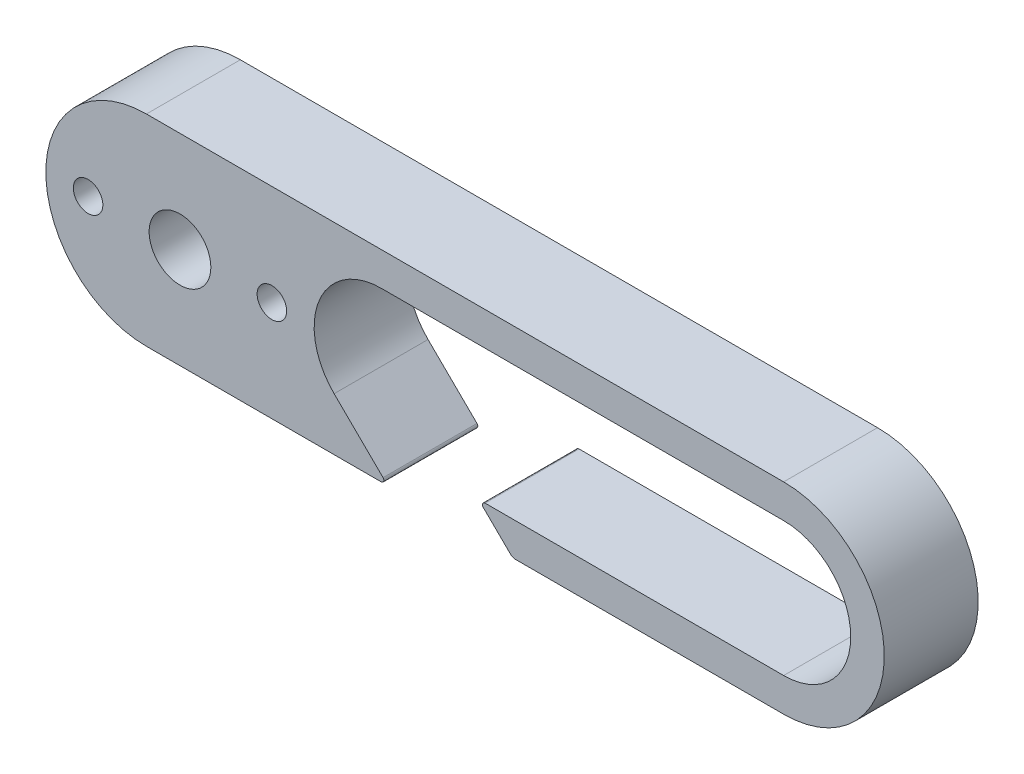
ISO-10303-21;
HEADER;
FILE_DESCRIPTION(('STEP AP214'),'2;1');
FILE_NAME('part.step','',(''),(''),'','','');
FILE_SCHEMA(('AUTOMOTIVE_DESIGN { 1 0 10303 214 1 1 1 1 }'));
ENDSEC;
DATA;
#1=APPLICATION_CONTEXT('core data for automotive mechanical design processes');
#2=APPLICATION_PROTOCOL_DEFINITION('international standard','automotive_design',2000,#1);
#3=PRODUCT_CONTEXT('',#1,'mechanical');
#4=PRODUCT('Part','Part','',(#3));
#5=PRODUCT_RELATED_PRODUCT_CATEGORY('part','',(#4));
#6=PRODUCT_DEFINITION_FORMATION('','',#4);
#7=PRODUCT_DEFINITION_CONTEXT('part definition',#1,'design');
#8=PRODUCT_DEFINITION('design','',#6,#7);
#9=PRODUCT_DEFINITION_SHAPE('','',#8);
#10=(LENGTH_UNIT() NAMED_UNIT(*) SI_UNIT(.MILLI.,.METRE.));
#11=(NAMED_UNIT(*) PLANE_ANGLE_UNIT() SI_UNIT($,.RADIAN.));
#12=(NAMED_UNIT(*) SI_UNIT($,.STERADIAN.) SOLID_ANGLE_UNIT());
#13=UNCERTAINTY_MEASURE_WITH_UNIT(LENGTH_MEASURE(1.E-05),#10,'distance_accuracy_value','');
#14=(GEOMETRIC_REPRESENTATION_CONTEXT(3) GLOBAL_UNCERTAINTY_ASSIGNED_CONTEXT((#13)) GLOBAL_UNIT_ASSIGNED_CONTEXT((#10,
#11,#12)) REPRESENTATION_CONTEXT('',''));
#15=CARTESIAN_POINT('',(0.,0.,0.));
#16=DIRECTION('',(0.,0.,1.));
#17=DIRECTION('',(1.,0.,0.));
#18=AXIS2_PLACEMENT_3D('',#15,#16,#17);
#19=CARTESIAN_POINT('',(0.,-7.5,7.));
#20=DIRECTION('',(0.,1.,0.));
#21=DIRECTION('',(0.,0.,1.));
#22=AXIS2_PLACEMENT_3D('',#19,#20,#21);
#23=PLANE('',#22);
#24=DIRECTION('',(1.,0.,0.));
#25=VECTOR('',#24,1.);
#26=CARTESIAN_POINT('',(0.,-7.5,0.));
#27=LINE('',#26,#25);
#28=CARTESIAN_POINT('',(-0.729629901181416,-7.5,0.));
#29=VERTEX_POINT('',#28);
#30=CARTESIAN_POINT('',(16.7703700988186,-7.5,0.));
#31=VERTEX_POINT('',#30);
#32=EDGE_CURVE('E177',#29,#31,#27,.T.);
#33=ORIENTED_EDGE('',*,*,#32,.T.);
#34=DIRECTION('',(0.,0.,-1.));
#35=VECTOR('',#34,1.);
#36=CARTESIAN_POINT('',(16.7703700988186,-7.5,7.));
#37=LINE('',#36,#35);
#38=CARTESIAN_POINT('',(16.7703700988186,-7.5,7.));
#39=VERTEX_POINT('',#38);
#40=EDGE_CURVE('E11',#39,#31,#37,.T.);
#41=ORIENTED_EDGE('',*,*,#40,.F.);
#42=DIRECTION('',(1.,0.,0.));
#43=VECTOR('',#42,1.);
#44=CARTESIAN_POINT('',(0.,-7.5,7.));
#45=LINE('',#44,#43);
#46=CARTESIAN_POINT('',(-0.729629901181416,-7.5,7.));
#47=VERTEX_POINT('',#46);
#48=EDGE_CURVE('E254',#47,#39,#45,.T.);
#49=ORIENTED_EDGE('',*,*,#48,.F.);
#50=DIRECTION('',(0.,0.,-1.));
#51=VECTOR('',#50,1.);
#52=CARTESIAN_POINT('',(-0.729629901181416,-7.5,7.));
#53=LINE('',#52,#51);
#54=EDGE_CURVE('E164',#47,#29,#53,.T.);
#55=ORIENTED_EDGE('',*,*,#54,.T.);
#56=EDGE_LOOP('',(#33,#41,#49,#55));
#57=FACE_BOUND('',#56,.T.);
#58=ADVANCED_FACE('F35',(#57),#23,.F.);
#59=CARTESIAN_POINT('',(16.7703700988186,-7.3,7.));
#60=DIRECTION('',(0.,0.,-1.));
#61=DIRECTION('',(-1.,0.,0.));
#62=AXIS2_PLACEMENT_3D('',#59,#60,#61);
#63=CYLINDRICAL_SURFACE('',#62,0.2);
#64=CARTESIAN_POINT('',(16.7703700988186,-7.3,0.));
#65=DIRECTION('',(0.,0.,1.));
#66=DIRECTION('',(1.,0.,0.));
#67=AXIS2_PLACEMENT_3D('',#64,#65,#66);
#68=CIRCLE('',#67,0.2);
#69=CARTESIAN_POINT('',(16.9094151219063,-7.15624158614354,0.));
#70=VERTEX_POINT('',#69);
#71=EDGE_CURVE('E180',#31,#70,#68,.T.);
#72=ORIENTED_EDGE('',*,*,#71,.T.);
#73=DIRECTION('',(0.,0.,-1.));
#74=VECTOR('',#73,1.);
#75=CARTESIAN_POINT('',(16.9094151219063,-7.15624158614354,7.));
#76=LINE('',#75,#74);
#77=CARTESIAN_POINT('',(16.9094151219063,-7.15624158614354,7.));
#78=VERTEX_POINT('',#77);
#79=EDGE_CURVE('E44',#78,#70,#76,.T.);
#80=ORIENTED_EDGE('',*,*,#79,.F.);
#81=CARTESIAN_POINT('',(16.7703700988186,-7.3,7.));
#82=DIRECTION('',(0.,0.,1.));
#83=DIRECTION('',(1.,0.,0.));
#84=AXIS2_PLACEMENT_3D('',#81,#82,#83);
#85=CIRCLE('',#84,0.2);
#86=EDGE_CURVE('E109',#39,#78,#85,.T.);
#87=ORIENTED_EDGE('',*,*,#86,.F.);
#88=ORIENTED_EDGE('',*,*,#40,.T.);
#89=EDGE_LOOP('',(#72,#80,#87,#88));
#90=FACE_BOUND('',#89,.T.);
#91=ADVANCED_FACE('F238',(#90),#63,.T.);
#92=CARTESIAN_POINT('',(4.75167357666447,4.82262724875488,7.));
#93=DIRECTION('',(0.701847248808947,0.712327480404422,0.));
#94=DIRECTION('',(-0.712327480404422,0.701847248808947,0.));
#95=AXIS2_PLACEMENT_3D('',#92,#93,#94);
#96=PLANE('',#95);
#97=DIRECTION('',(0.712327480404422,-0.701847248808947,0.));
#98=VECTOR('',#97,1.);
#99=CARTESIAN_POINT('',(4.75167357666447,4.82262724875488,0.));
#100=LINE('',#99,#98);
#101=CARTESIAN_POINT('',(13.2611350355033,-3.56163740202211,0.));
#102=VERTEX_POINT('',#101);
#103=EDGE_CURVE('E183',#102,#70,#100,.T.);
#104=ORIENTED_EDGE('',*,*,#103,.F.);
#105=DIRECTION('',(0.,0.,-1.));
#106=VECTOR('',#105,1.);
#107=CARTESIAN_POINT('',(13.2611350355033,-3.56163740202211,7.));
#108=LINE('',#107,#106);
#109=CARTESIAN_POINT('',(13.2611350355033,-3.56163740202211,7.));
#110=VERTEX_POINT('',#109);
#111=EDGE_CURVE('E231',#110,#102,#108,.T.);
#112=ORIENTED_EDGE('',*,*,#111,.F.);
#113=DIRECTION('',(0.712327480404422,-0.701847248808947,0.));
#114=VECTOR('',#113,1.);
#115=CARTESIAN_POINT('',(4.75167357666447,4.82262724875488,7.));
#116=LINE('',#115,#114);
#117=EDGE_CURVE('E237',#110,#78,#116,.T.);
#118=ORIENTED_EDGE('',*,*,#117,.T.);
#119=ORIENTED_EDGE('',*,*,#79,.T.);
#120=EDGE_LOOP('',(#104,#112,#118,#119));
#121=FACE_BOUND('',#120,.T.);
#122=ADVANCED_FACE('F235',(#121),#96,.T.);
#123=CARTESIAN_POINT('',(16.7703712795481,0.,7.));
#124=DIRECTION('',(0.,0.,-1.));
#125=DIRECTION('',(-1.,0.,0.));
#126=AXIS2_PLACEMENT_3D('',#123,#124,#125);
#127=CYLINDRICAL_SURFACE('',#126,5.);
#128=CARTESIAN_POINT('',(16.7703712795481,0.,0.));
#129=DIRECTION('',(0.,0.,1.));
#130=DIRECTION('',(1.,0.,0.));
#131=AXIS2_PLACEMENT_3D('',#128,#129,#130);
#132=CIRCLE('',#131,5.);
#133=CARTESIAN_POINT('',(16.7703712795481,5.,0.));
#134=VERTEX_POINT('',#133);
#135=EDGE_CURVE('E186',#134,#102,#132,.T.);
#136=ORIENTED_EDGE('',*,*,#135,.F.);
#137=DIRECTION('',(0.,0.,-1.));
#138=VECTOR('',#137,1.);
#139=CARTESIAN_POINT('',(16.7703712795481,5.,7.));
#140=LINE('',#139,#138);
#141=CARTESIAN_POINT('',(16.7703712795481,5.,7.));
#142=VERTEX_POINT('',#141);
#143=EDGE_CURVE('E229',#142,#134,#140,.T.);
#144=ORIENTED_EDGE('',*,*,#143,.F.);
#145=CARTESIAN_POINT('',(16.7703712795481,0.,7.));
#146=DIRECTION('',(0.,0.,1.));
#147=DIRECTION('',(1.,0.,0.));
#148=AXIS2_PLACEMENT_3D('',#145,#146,#147);
#149=CIRCLE('',#148,5.);
#150=EDGE_CURVE('E250',#142,#110,#149,.T.);
#151=ORIENTED_EDGE('',*,*,#150,.T.);
#152=ORIENTED_EDGE('',*,*,#111,.T.);
#153=EDGE_LOOP('',(#136,#144,#151,#152));
#154=FACE_BOUND('',#153,.T.);
#155=ADVANCED_FACE('F246',(#154),#127,.F.);
#156=CARTESIAN_POINT('',(0.,5.,7.));
#157=DIRECTION('',(0.,1.,0.));
#158=DIRECTION('',(-1.,0.,0.));
#159=AXIS2_PLACEMENT_3D('',#156,#157,#158);
#160=PLANE('',#159);
#161=DIRECTION('',(1.,0.,0.));
#162=VECTOR('',#161,1.);
#163=CARTESIAN_POINT('',(0.,5.,0.));
#164=LINE('',#163,#162);
#165=CARTESIAN_POINT('',(46.7703712795481,5.,0.));
#166=VERTEX_POINT('',#165);
#167=EDGE_CURVE('E189',#134,#166,#164,.T.);
#168=ORIENTED_EDGE('',*,*,#167,.T.);
#169=DIRECTION('',(0.,0.,-1.));
#170=VECTOR('',#169,1.);
#171=CARTESIAN_POINT('',(46.7703712795481,5.,7.));
#172=LINE('',#171,#170);
#173=CARTESIAN_POINT('',(46.7703712795481,5.,7.));
#174=VERTEX_POINT('',#173);
#175=EDGE_CURVE('E227',#174,#166,#172,.T.);
#176=ORIENTED_EDGE('',*,*,#175,.F.);
#177=DIRECTION('',(1.,0.,0.));
#178=VECTOR('',#177,1.);
#179=CARTESIAN_POINT('',(0.,5.,7.));
#180=LINE('',#179,#178);
#181=EDGE_CURVE('E252',#142,#174,#180,.T.);
#182=ORIENTED_EDGE('',*,*,#181,.F.);
#183=ORIENTED_EDGE('',*,*,#143,.T.);
#184=EDGE_LOOP('',(#168,#176,#182,#183));
#185=FACE_BOUND('',#184,.T.);
#186=ADVANCED_FACE('F462',(#185),#160,.F.);
#187=CARTESIAN_POINT('',(46.7703700988186,0.,7.));
#188=DIRECTION('',(0.,0.,-1.));
#189=DIRECTION('',(-1.,0.,0.));
#190=AXIS2_PLACEMENT_3D('',#187,#188,#189);
#191=CYLINDRICAL_SURFACE('',#190,5.00000000000014);
#192=CARTESIAN_POINT('',(46.7703700988186,0.,0.));
#193=DIRECTION('',(0.,0.,1.));
#194=DIRECTION('',(1.,0.,0.));
#195=AXIS2_PLACEMENT_3D('',#192,#193,#194);
#196=CIRCLE('',#195,5.00000000000014);
#197=CARTESIAN_POINT('',(46.7703712795481,-5.,0.));
#198=VERTEX_POINT('',#197);
#199=EDGE_CURVE('E192',#198,#166,#196,.T.);
#200=ORIENTED_EDGE('',*,*,#199,.F.);
#201=DIRECTION('',(0.,0.,-1.));
#202=VECTOR('',#201,1.);
#203=CARTESIAN_POINT('',(46.7703712795481,-5.,7.));
#204=LINE('',#203,#202);
#205=CARTESIAN_POINT('',(46.7703712795481,-5.,7.));
#206=VERTEX_POINT('',#205);
#207=EDGE_CURVE('E225',#206,#198,#204,.T.);
#208=ORIENTED_EDGE('',*,*,#207,.F.);
#209=CARTESIAN_POINT('',(46.7703700988186,0.,7.));
#210=DIRECTION('',(0.,0.,1.));
#211=DIRECTION('',(1.,0.,0.));
#212=AXIS2_PLACEMENT_3D('',#209,#210,#211);
#213=CIRCLE('',#212,5.00000000000014);
#214=EDGE_CURVE('E259',#206,#174,#213,.T.);
#215=ORIENTED_EDGE('',*,*,#214,.T.);
#216=ORIENTED_EDGE('',*,*,#175,.T.);
#217=EDGE_LOOP('',(#200,#208,#215,#216));
#218=FACE_BOUND('',#217,.T.);
#219=ADVANCED_FACE('F453',(#218),#191,.F.);
#220=CARTESIAN_POINT('',(0.,-5.,7.));
#221=DIRECTION('',(0.,1.,0.));
#222=DIRECTION('',(0.,0.,1.));
#223=AXIS2_PLACEMENT_3D('',#220,#221,#222);
#224=PLANE('',#223);
#225=DIRECTION('',(1.,0.,0.));
#226=VECTOR('',#225,1.);
#227=CARTESIAN_POINT('',(0.,-5.,0.));
#228=LINE('',#227,#226);
#229=CARTESIAN_POINT('',(24.5160484249601,-5.,0.));
#230=VERTEX_POINT('',#229);
#231=EDGE_CURVE('E195',#230,#198,#228,.T.);
#232=ORIENTED_EDGE('',*,*,#231,.F.);
#233=DIRECTION('',(0.,0.,-1.));
#234=VECTOR('',#233,1.);
#235=CARTESIAN_POINT('',(24.5160484249601,-5.,7.));
#236=LINE('',#235,#234);
#237=CARTESIAN_POINT('',(24.5160484249601,-5.,7.));
#238=VERTEX_POINT('',#237);
#239=EDGE_CURVE('E223',#238,#230,#236,.T.);
#240=ORIENTED_EDGE('',*,*,#239,.F.);
#241=DIRECTION('',(1.,0.,0.));
#242=VECTOR('',#241,1.);
#243=CARTESIAN_POINT('',(0.,-5.,7.));
#244=LINE('',#243,#242);
#245=EDGE_CURVE('E262',#238,#206,#244,.T.);
#246=ORIENTED_EDGE('',*,*,#245,.T.);
#247=ORIENTED_EDGE('',*,*,#207,.T.);
#248=EDGE_LOOP('',(#232,#240,#246,#247));
#249=FACE_BOUND('',#248,.T.);
#250=ADVANCED_FACE('F444',(#249),#224,.T.);
#251=CARTESIAN_POINT('',(24.5160484249601,-5.2,7.));
#252=DIRECTION('',(0.,0.,-1.));
#253=DIRECTION('',(-1.,0.,0.));
#254=AXIS2_PLACEMENT_3D('',#251,#252,#253);
#255=CYLINDRICAL_SURFACE('',#254,0.199999999999999);
#256=CARTESIAN_POINT('',(24.5160484249601,-5.2,0.));
#257=DIRECTION('',(0.,0.,1.));
#258=DIRECTION('',(1.,0.,0.));
#259=AXIS2_PLACEMENT_3D('',#256,#257,#258);
#260=CIRCLE('',#259,0.199999999999999);
#261=CARTESIAN_POINT('',(24.3756789751983,-5.34246549608088,0.));
#262=VERTEX_POINT('',#261);
#263=EDGE_CURVE('E198',#262,#230,#260,.F.);
#264=ORIENTED_EDGE('',*,*,#263,.F.);
#265=DIRECTION('',(0.,0.,-1.));
#266=VECTOR('',#265,1.);
#267=CARTESIAN_POINT('',(24.3756789751983,-5.34246549608088,7.));
#268=LINE('',#267,#266);
#269=CARTESIAN_POINT('',(24.3756789751983,-5.34246549608088,7.));
#270=VERTEX_POINT('',#269);
#271=EDGE_CURVE('E221',#270,#262,#268,.T.);
#272=ORIENTED_EDGE('',*,*,#271,.F.);
#273=CARTESIAN_POINT('',(24.5160484249601,-5.2,7.));
#274=DIRECTION('',(0.,0.,1.));
#275=DIRECTION('',(1.,0.,0.));
#276=AXIS2_PLACEMENT_3D('',#273,#274,#275);
#277=CIRCLE('',#276,0.199999999999999);
#278=EDGE_CURVE('E265',#270,#238,#277,.F.);
#279=ORIENTED_EDGE('',*,*,#278,.T.);
#280=ORIENTED_EDGE('',*,*,#239,.T.);
#281=EDGE_LOOP('',(#264,#272,#279,#280));
#282=FACE_BOUND('',#281,.T.);
#283=ADVANCED_FACE('F436',(#282),#255,.T.);
#284=CARTESIAN_POINT('',(9.33626564468662,9.47567806862821,7.));
#285=DIRECTION('',(-0.701847248808947,-0.712327480404422,0.));
#286=DIRECTION('',(0.712327480404422,-0.701847248808947,0.));
#287=AXIS2_PLACEMENT_3D('',#284,#285,#286);
#288=PLANE('',#287);
#289=DIRECTION('',(-0.712327480404422,0.701847248808947,0.));
#290=VECTOR('',#289,1.);
#291=CARTESIAN_POINT('',(9.33626564468662,9.47567806862821,0.));
#292=LINE('',#291,#290);
#293=CARTESIAN_POINT('',(26.4194464744141,-7.35616374020221,0.));
#294=VERTEX_POINT('',#293);
#295=EDGE_CURVE('E201',#294,#262,#292,.T.);
#296=ORIENTED_EDGE('',*,*,#295,.F.);
#297=DIRECTION('',(0.,0.,-1.));
#298=VECTOR('',#297,1.);
#299=CARTESIAN_POINT('',(26.4194464744141,-7.35616374020221,7.));
#300=LINE('',#299,#298);
#301=CARTESIAN_POINT('',(26.4194464744141,-7.35616374020221,7.));
#302=VERTEX_POINT('',#301);
#303=EDGE_CURVE('E219',#302,#294,#300,.T.);
#304=ORIENTED_EDGE('',*,*,#303,.F.);
#305=DIRECTION('',(-0.712327480404422,0.701847248808947,0.));
#306=VECTOR('',#305,1.);
#307=CARTESIAN_POINT('',(9.33626564468662,9.47567806862821,7.));
#308=LINE('',#307,#306);
#309=EDGE_CURVE('E268',#302,#270,#308,.T.);
#310=ORIENTED_EDGE('',*,*,#309,.T.);
#311=ORIENTED_EDGE('',*,*,#271,.T.);
#312=EDGE_LOOP('',(#296,#304,#310,#311));
#313=FACE_BOUND('',#312,.T.);
#314=ADVANCED_FACE('F281',(#313),#288,.T.);
#315=CARTESIAN_POINT('',(26.7703700988186,-7.,7.));
#316=DIRECTION('',(0.,0.,-1.));
#317=DIRECTION('',(-1.,0.,0.));
#318=AXIS2_PLACEMENT_3D('',#315,#316,#317);
#319=CYLINDRICAL_SURFACE('',#318,0.499999999999999);
#320=CARTESIAN_POINT('',(26.7703700988186,-7.,0.));
#321=DIRECTION('',(0.,0.,1.));
#322=DIRECTION('',(1.,0.,0.));
#323=AXIS2_PLACEMENT_3D('',#320,#321,#322);
#324=CIRCLE('',#323,0.499999999999999);
#325=CARTESIAN_POINT('',(26.7703700988186,-7.5,0.));
#326=VERTEX_POINT('',#325);
#327=EDGE_CURVE('E204',#326,#294,#324,.F.);
#328=ORIENTED_EDGE('',*,*,#327,.F.);
#329=DIRECTION('',(0.,0.,-1.));
#330=VECTOR('',#329,1.);
#331=CARTESIAN_POINT('',(26.7703700988186,-7.5,7.));
#332=LINE('',#331,#330);
#333=CARTESIAN_POINT('',(26.7703700988186,-7.5,7.));
#334=VERTEX_POINT('',#333);
#335=EDGE_CURVE('E217',#334,#326,#332,.T.);
#336=ORIENTED_EDGE('',*,*,#335,.F.);
#337=CARTESIAN_POINT('',(26.7703700988186,-7.,7.));
#338=DIRECTION('',(0.,0.,1.));
#339=DIRECTION('',(1.,0.,0.));
#340=AXIS2_PLACEMENT_3D('',#337,#338,#339);
#341=CIRCLE('',#340,0.499999999999999);
#342=EDGE_CURVE('E271',#334,#302,#341,.F.);
#343=ORIENTED_EDGE('',*,*,#342,.T.);
#344=ORIENTED_EDGE('',*,*,#303,.T.);
#345=EDGE_LOOP('',(#328,#336,#343,#344));
#346=FACE_BOUND('',#345,.T.);
#347=ADVANCED_FACE('F275',(#346),#319,.T.);
#348=CARTESIAN_POINT('',(0.,-7.50000000000028,7.));
#349=DIRECTION('',(0.,1.,0.));
#350=DIRECTION('',(-1.,0.,0.));
#351=AXIS2_PLACEMENT_3D('',#348,#349,#350);
#352=PLANE('',#351);
#353=DIRECTION('',(1.,0.,0.));
#354=VECTOR('',#353,1.);
#355=CARTESIAN_POINT('',(0.,-7.50000000000028,0.));
#356=LINE('',#355,#354);
#357=CARTESIAN_POINT('',(46.7703718699128,-7.49999999999979,0.));
#358=VERTEX_POINT('',#357);
#359=EDGE_CURVE('E207',#326,#358,#356,.T.);
#360=ORIENTED_EDGE('',*,*,#359,.T.);
#361=DIRECTION('',(0.,0.,-1.));
#362=VECTOR('',#361,1.);
#363=CARTESIAN_POINT('',(46.7703718699128,-7.49999999999979,7.));
#364=LINE('',#363,#362);
#365=CARTESIAN_POINT('',(46.7703718699128,-7.49999999999979,7.));
#366=VERTEX_POINT('',#365);
#367=EDGE_CURVE('E160',#366,#358,#364,.T.);
#368=ORIENTED_EDGE('',*,*,#367,.F.);
#369=DIRECTION('',(1.,0.,0.));
#370=VECTOR('',#369,1.);
#371=CARTESIAN_POINT('',(0.,-7.50000000000028,7.));
#372=LINE('',#371,#370);
#373=EDGE_CURVE('E147',#334,#366,#372,.T.);
#374=ORIENTED_EDGE('',*,*,#373,.F.);
#375=ORIENTED_EDGE('',*,*,#335,.T.);
#376=EDGE_LOOP('',(#360,#368,#374,#375));
#377=FACE_BOUND('',#376,.T.);
#378=ADVANCED_FACE('F285',(#377),#352,.F.);
#379=CARTESIAN_POINT('',(46.7703700988186,0.,7.));
#380=DIRECTION('',(0.,0.,-1.));
#381=DIRECTION('',(-1.,0.,0.));
#382=AXIS2_PLACEMENT_3D('',#379,#380,#381);
#383=CYLINDRICAL_SURFACE('',#382,7.50000000000004);
#384=CARTESIAN_POINT('',(46.7703700988186,0.,0.));
#385=DIRECTION('',(0.,0.,1.));
#386=DIRECTION('',(1.,0.,0.));
#387=AXIS2_PLACEMENT_3D('',#384,#385,#386);
#388=CIRCLE('',#387,7.50000000000004);
#389=CARTESIAN_POINT('',(46.7703712795481,7.49999999999999,0.));
#390=VERTEX_POINT('',#389);
#391=EDGE_CURVE('E156',#358,#390,#388,.T.);
#392=ORIENTED_EDGE('',*,*,#391,.T.);
#393=DIRECTION('',(0.,0.,-1.));
#394=VECTOR('',#393,1.);
#395=CARTESIAN_POINT('',(46.7703712795481,7.49999999999999,7.));
#396=LINE('',#395,#394);
#397=CARTESIAN_POINT('',(46.7703712795481,7.49999999999999,7.));
#398=VERTEX_POINT('',#397);
#399=EDGE_CURVE('E153',#398,#390,#396,.T.);
#400=ORIENTED_EDGE('',*,*,#399,.F.);
#401=CARTESIAN_POINT('',(46.7703700988186,0.,7.));
#402=DIRECTION('',(0.,0.,1.));
#403=DIRECTION('',(1.,0.,0.));
#404=AXIS2_PLACEMENT_3D('',#401,#402,#403);
#405=CIRCLE('',#404,7.50000000000004);
#406=EDGE_CURVE('E140',#366,#398,#405,.T.);
#407=ORIENTED_EDGE('',*,*,#406,.F.);
#408=ORIENTED_EDGE('',*,*,#367,.T.);
#409=EDGE_LOOP('',(#392,#400,#407,#408));
#410=FACE_BOUND('',#409,.T.);
#411=ADVANCED_FACE('F154',(#410),#383,.T.);
#412=CARTESIAN_POINT('',(0.,7.5,7.));
#413=DIRECTION('',(0.,1.,0.));
#414=DIRECTION('',(-1.,0.,0.));
#415=AXIS2_PLACEMENT_3D('',#412,#413,#414);
#416=PLANE('',#415);
#417=DIRECTION('',(1.,0.,0.));
#418=VECTOR('',#417,1.);
#419=CARTESIAN_POINT('',(0.,7.5,0.));
#420=LINE('',#419,#418);
#421=CARTESIAN_POINT('',(-0.729629901181417,7.5,0.));
#422=VERTEX_POINT('',#421);
#423=EDGE_CURVE('E210',#422,#390,#420,.T.);
#424=ORIENTED_EDGE('',*,*,#423,.F.);
#425=DIRECTION('',(0.,0.,-1.));
#426=VECTOR('',#425,1.);
#427=CARTESIAN_POINT('',(-0.729629901181417,7.5,7.));
#428=LINE('',#427,#426);
#429=CARTESIAN_POINT('',(-0.729629901181417,7.5,7.));
#430=VERTEX_POINT('',#429);
#431=EDGE_CURVE('E98',#430,#422,#428,.T.);
#432=ORIENTED_EDGE('',*,*,#431,.F.);
#433=DIRECTION('',(1.,0.,0.));
#434=VECTOR('',#433,1.);
#435=CARTESIAN_POINT('',(0.,7.5,7.));
#436=LINE('',#435,#434);
#437=EDGE_CURVE('E144',#430,#398,#436,.T.);
#438=ORIENTED_EDGE('',*,*,#437,.T.);
#439=ORIENTED_EDGE('',*,*,#399,.T.);
#440=EDGE_LOOP('',(#424,#432,#438,#439));
#441=FACE_BOUND('',#440,.T.);
#442=ADVANCED_FACE('F162',(#441),#416,.T.);
#443=CARTESIAN_POINT('',(8.62037068918334,0.,7.));
#444=DIRECTION('',(0.,0.,-1.));
#445=DIRECTION('',(-1.,0.,0.));
#446=AXIS2_PLACEMENT_3D('',#443,#444,#445);
#447=CYLINDRICAL_SURFACE('',#446,1.1);
#448=CARTESIAN_POINT('',(8.62037068918334,0.,7.));
#449=DIRECTION('',(0.,0.,1.));
#450=DIRECTION('',(1.,0.,0.));
#451=AXIS2_PLACEMENT_3D('',#448,#449,#450);
#452=CIRCLE('',#451,1.1);
#453=CARTESIAN_POINT('',(9.72037068918334,0.,7.));
#454=VERTEX_POINT('',#453);
#455=EDGE_CURVE('E516',#454,#454,#452,.T.);
#456=ORIENTED_EDGE('',*,*,#455,.T.);
#457=EDGE_LOOP('',(#456));
#458=FACE_BOUND('',#457,.T.);
#459=CARTESIAN_POINT('',(8.62037068918334,0.,0.));
#460=DIRECTION('',(0.,0.,1.));
#461=DIRECTION('',(1.,0.,0.));
#462=AXIS2_PLACEMENT_3D('',#459,#460,#461);
#463=CIRCLE('',#462,1.1);
#464=CARTESIAN_POINT('',(9.72037068918334,0.,0.));
#465=VERTEX_POINT('',#464);
#466=EDGE_CURVE('E174',#465,#465,#463,.T.);
#467=ORIENTED_EDGE('',*,*,#466,.F.);
#468=EDGE_LOOP('',(#467));
#469=FACE_BOUND('',#468,.T.);
#470=ADVANCED_FACE('F303',(#458,#469),#447,.F.);
#471=CARTESIAN_POINT('',(-5.07962931081667,0.,7.));
#472=DIRECTION('',(0.,0.,-1.));
#473=DIRECTION('',(-1.,0.,0.));
#474=AXIS2_PLACEMENT_3D('',#471,#472,#473);
#475=CYLINDRICAL_SURFACE('',#474,1.1);
#476=CARTESIAN_POINT('',(-5.07962931081667,0.,7.));
#477=DIRECTION('',(0.,0.,1.));
#478=DIRECTION('',(1.,0.,0.));
#479=AXIS2_PLACEMENT_3D('',#476,#477,#478);
#480=CIRCLE('',#479,1.1);
#481=CARTESIAN_POINT('',(-3.97962931081667,0.,7.));
#482=VERTEX_POINT('',#481);
#483=EDGE_CURVE('E317',#482,#482,#480,.T.);
#484=ORIENTED_EDGE('',*,*,#483,.T.);
#485=EDGE_LOOP('',(#484));
#486=FACE_BOUND('',#485,.T.);
#487=CARTESIAN_POINT('',(-5.07962931081667,0.,0.));
#488=DIRECTION('',(0.,0.,1.));
#489=DIRECTION('',(1.,0.,0.));
#490=AXIS2_PLACEMENT_3D('',#487,#488,#489);
#491=CIRCLE('',#490,1.1);
#492=CARTESIAN_POINT('',(-3.97962931081667,0.,0.));
#493=VERTEX_POINT('',#492);
#494=EDGE_CURVE('E171',#493,#493,#491,.T.);
#495=ORIENTED_EDGE('',*,*,#494,.F.);
#496=EDGE_LOOP('',(#495));
#497=FACE_BOUND('',#496,.T.);
#498=ADVANCED_FACE('F305',(#486,#497),#475,.F.);
#499=CARTESIAN_POINT('',(1.77037068918333,0.,7.));
#500=DIRECTION('',(0.,0.,-1.));
#501=DIRECTION('',(-1.,0.,0.));
#502=AXIS2_PLACEMENT_3D('',#499,#500,#501);
#503=CYLINDRICAL_SURFACE('',#502,2.30000000000002);
#504=CARTESIAN_POINT('',(1.77037068918333,0.,7.));
#505=DIRECTION('',(0.,0.,1.));
#506=DIRECTION('',(1.,0.,0.));
#507=AXIS2_PLACEMENT_3D('',#504,#505,#506);
#508=CIRCLE('',#507,2.30000000000002);
#509=CARTESIAN_POINT('',(4.07037068918335,0.,7.));
#510=VERTEX_POINT('',#509);
#511=EDGE_CURVE('E213',#510,#510,#508,.T.);
#512=ORIENTED_EDGE('',*,*,#511,.T.);
#513=EDGE_LOOP('',(#512));
#514=FACE_BOUND('',#513,.T.);
#515=CARTESIAN_POINT('',(1.77037068918333,0.,0.));
#516=DIRECTION('',(0.,0.,1.));
#517=DIRECTION('',(1.,0.,0.));
#518=AXIS2_PLACEMENT_3D('',#515,#516,#517);
#519=CIRCLE('',#518,2.30000000000002);
#520=CARTESIAN_POINT('',(4.07037068918335,0.,0.));
#521=VERTEX_POINT('',#520);
#522=EDGE_CURVE('E168',#521,#521,#519,.T.);
#523=ORIENTED_EDGE('',*,*,#522,.F.);
#524=EDGE_LOOP('',(#523));
#525=FACE_BOUND('',#524,.T.);
#526=ADVANCED_FACE('F37',(#514,#525),#503,.F.);
#527=CARTESIAN_POINT('',(-0.729629901181416,0.,7.));
#528=DIRECTION('',(0.,0.,-1.));
#529=DIRECTION('',(-1.,0.,0.));
#530=AXIS2_PLACEMENT_3D('',#527,#528,#529);
#531=CYLINDRICAL_SURFACE('',#530,7.5);
#532=CARTESIAN_POINT('',(-0.729629901181416,0.,0.));
#533=DIRECTION('',(0.,0.,1.));
#534=DIRECTION('',(1.,0.,0.));
#535=AXIS2_PLACEMENT_3D('',#532,#533,#534);
#536=CIRCLE('',#535,7.5);
#537=EDGE_CURVE('E101',#422,#29,#536,.T.);
#538=ORIENTED_EDGE('',*,*,#537,.T.);
#539=ORIENTED_EDGE('',*,*,#54,.F.);
#540=CARTESIAN_POINT('',(-0.729629901181416,0.,7.));
#541=DIRECTION('',(0.,0.,1.));
#542=DIRECTION('',(1.,0.,0.));
#543=AXIS2_PLACEMENT_3D('',#540,#541,#542);
#544=CIRCLE('',#543,7.5);
#545=EDGE_CURVE('E52',#430,#47,#544,.T.);
#546=ORIENTED_EDGE('',*,*,#545,.F.);
#547=ORIENTED_EDGE('',*,*,#431,.T.);
#548=EDGE_LOOP('',(#538,#539,#546,#547));
#549=FACE_BOUND('',#548,.T.);
#550=ADVANCED_FACE('F312',(#549),#531,.T.);
#551=CARTESIAN_POINT('',(0.,0.,7.));
#552=DIRECTION('',(0.,0.,1.));
#553=DIRECTION('',(1.,0.,0.));
#554=AXIS2_PLACEMENT_3D('',#551,#552,#553);
#555=PLANE('',#554);
#556=ORIENTED_EDGE('',*,*,#511,.F.);
#557=EDGE_LOOP('',(#556));
#558=FACE_BOUND('',#557,.T.);
#559=ORIENTED_EDGE('',*,*,#483,.F.);
#560=EDGE_LOOP('',(#559));
#561=FACE_BOUND('',#560,.T.);
#562=ORIENTED_EDGE('',*,*,#455,.F.);
#563=EDGE_LOOP('',(#562));
#564=FACE_BOUND('',#563,.T.);
#565=ORIENTED_EDGE('',*,*,#48,.T.);
#566=ORIENTED_EDGE('',*,*,#86,.T.);
#567=ORIENTED_EDGE('',*,*,#117,.F.);
#568=ORIENTED_EDGE('',*,*,#150,.F.);
#569=ORIENTED_EDGE('',*,*,#181,.T.);
#570=ORIENTED_EDGE('',*,*,#214,.F.);
#571=ORIENTED_EDGE('',*,*,#245,.F.);
#572=ORIENTED_EDGE('',*,*,#278,.F.);
#573=ORIENTED_EDGE('',*,*,#309,.F.);
#574=ORIENTED_EDGE('',*,*,#342,.F.);
#575=ORIENTED_EDGE('',*,*,#373,.T.);
#576=ORIENTED_EDGE('',*,*,#406,.T.);
#577=ORIENTED_EDGE('',*,*,#437,.F.);
#578=ORIENTED_EDGE('',*,*,#545,.T.);
#579=EDGE_LOOP('',(#565,#566,#567,#568,#569,#570,#571,#572,#573,#574,#575,#576,#577,#578));
#580=FACE_BOUND('',#579,.T.);
#581=ADVANCED_FACE('F142',(#558,#561,#564,#580),#555,.T.);
#582=CARTESIAN_POINT('',(0.,0.,0.));
#583=DIRECTION('',(0.,0.,1.));
#584=DIRECTION('',(1.,0.,0.));
#585=AXIS2_PLACEMENT_3D('',#582,#583,#584);
#586=PLANE('',#585);
#587=ORIENTED_EDGE('',*,*,#522,.T.);
#588=EDGE_LOOP('',(#587));
#589=FACE_BOUND('',#588,.T.);
#590=ORIENTED_EDGE('',*,*,#494,.T.);
#591=EDGE_LOOP('',(#590));
#592=FACE_BOUND('',#591,.T.);
#593=ORIENTED_EDGE('',*,*,#466,.T.);
#594=EDGE_LOOP('',(#593));
#595=FACE_BOUND('',#594,.T.);
#596=ORIENTED_EDGE('',*,*,#32,.F.);
#597=ORIENTED_EDGE('',*,*,#537,.F.);
#598=ORIENTED_EDGE('',*,*,#423,.T.);
#599=ORIENTED_EDGE('',*,*,#391,.F.);
#600=ORIENTED_EDGE('',*,*,#359,.F.);
#601=ORIENTED_EDGE('',*,*,#327,.T.);
#602=ORIENTED_EDGE('',*,*,#295,.T.);
#603=ORIENTED_EDGE('',*,*,#263,.T.);
#604=ORIENTED_EDGE('',*,*,#231,.T.);
#605=ORIENTED_EDGE('',*,*,#199,.T.);
#606=ORIENTED_EDGE('',*,*,#167,.F.);
#607=ORIENTED_EDGE('',*,*,#135,.T.);
#608=ORIENTED_EDGE('',*,*,#103,.T.);
#609=ORIENTED_EDGE('',*,*,#71,.F.);
#610=EDGE_LOOP('',(#596,#597,#598,#599,#600,#601,#602,#603,#604,#605,#606,#607,#608,#609));
#611=FACE_BOUND('',#610,.T.);
#612=ADVANCED_FACE('F242',(#589,#592,#595,#611),#586,.F.);
#613=CLOSED_SHELL('',(#58,#91,#122,#155,#186,#219,#250,#283,#314,#347,#378,#411,#442,#470,#498,
#526,#550,#581,#612));
#614=MANIFOLD_SOLID_BREP('B2',#613);
#615=ADVANCED_BREP_SHAPE_REPRESENTATION('',(#18,#614),#14);
#616=SHAPE_DEFINITION_REPRESENTATION(#9,#615);
ENDSEC;
END-ISO-10303-21;
